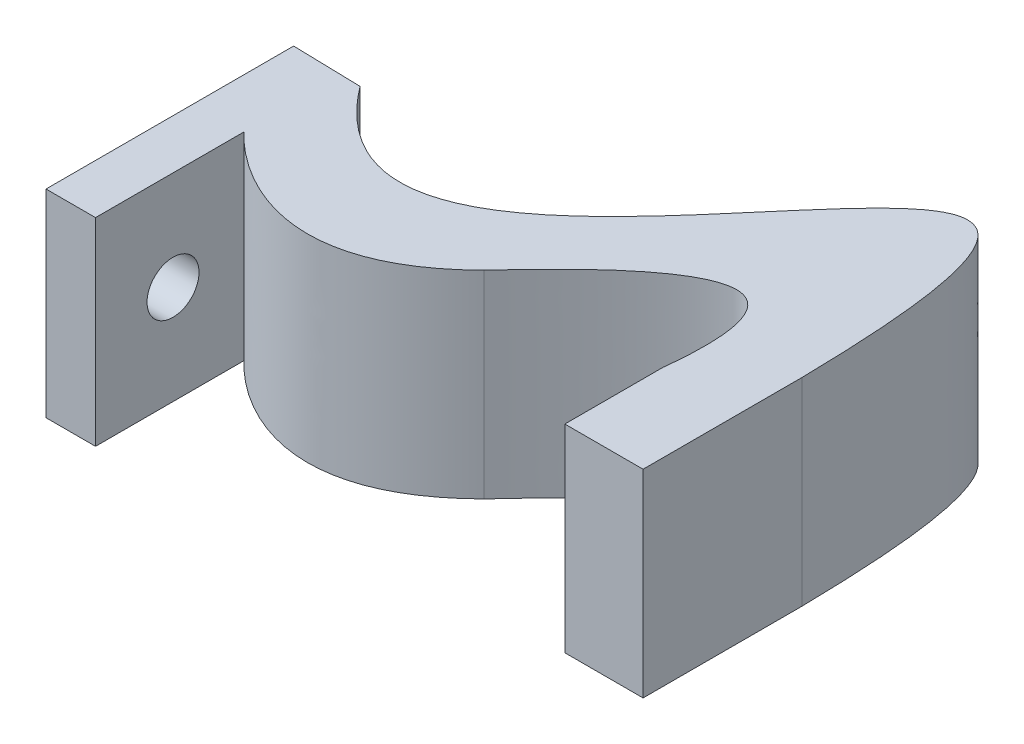
ISO-10303-21;
HEADER;
FILE_DESCRIPTION(('STEP AP214'),'2;1');
FILE_NAME('part.step','',(''),(''),'','','');
FILE_SCHEMA(('AUTOMOTIVE_DESIGN { 1 0 10303 214 1 1 1 1 }'));
ENDSEC;
DATA;
#1=APPLICATION_CONTEXT('core data for automotive mechanical design processes');
#2=APPLICATION_PROTOCOL_DEFINITION('international standard','automotive_design',2000,#1);
#3=PRODUCT_CONTEXT('',#1,'mechanical');
#4=PRODUCT('Part','Part','',(#3));
#5=PRODUCT_RELATED_PRODUCT_CATEGORY('part','',(#4));
#6=PRODUCT_DEFINITION_FORMATION('','',#4);
#7=PRODUCT_DEFINITION_CONTEXT('part definition',#1,'design');
#8=PRODUCT_DEFINITION('design','',#6,#7);
#9=PRODUCT_DEFINITION_SHAPE('','',#8);
#10=(LENGTH_UNIT() NAMED_UNIT(*) SI_UNIT(.MILLI.,.METRE.));
#11=(NAMED_UNIT(*) PLANE_ANGLE_UNIT() SI_UNIT($,.RADIAN.));
#12=(NAMED_UNIT(*) SI_UNIT($,.STERADIAN.) SOLID_ANGLE_UNIT());
#13=UNCERTAINTY_MEASURE_WITH_UNIT(LENGTH_MEASURE(1.E-05),#10,'distance_accuracy_value','');
#14=(GEOMETRIC_REPRESENTATION_CONTEXT(3) GLOBAL_UNCERTAINTY_ASSIGNED_CONTEXT((#13)) GLOBAL_UNIT_ASSIGNED_CONTEXT((#10,
#11,#12)) REPRESENTATION_CONTEXT('',''));
#15=CARTESIAN_POINT('',(0.,0.,0.));
#16=DIRECTION('',(0.,0.,1.));
#17=DIRECTION('',(1.,0.,0.));
#18=AXIS2_PLACEMENT_3D('',#15,#16,#17);
#19=CARTESIAN_POINT('',(-29.1994486491968,20.,4.82477370069274));
#20=DIRECTION('',(1.,0.,0.));
#21=DIRECTION('',(0.,0.,-1.));
#22=AXIS2_PLACEMENT_3D('',#19,#20,#21);
#23=PLANE('',#22);
#24=DIRECTION('',(0.,0.,1.));
#25=VECTOR('',#24,1.);
#26=CARTESIAN_POINT('',(-29.1994486491968,0.,4.82477370069274));
#27=LINE('',#26,#25);
#28=CARTESIAN_POINT('',(-29.1994486491968,0.,-9.99580208202526));
#29=VERTEX_POINT('',#28);
#30=CARTESIAN_POINT('',(-29.1994486491968,0.,15.0041979179747));
#31=VERTEX_POINT('',#30);
#32=EDGE_CURVE('E274',#29,#31,#27,.T.);
#33=ORIENTED_EDGE('',*,*,#32,.T.);
#34=DIRECTION('',(0.,-1.,0.));
#35=VECTOR('',#34,1.);
#36=CARTESIAN_POINT('',(-29.1994486491968,20.,15.0041979179747));
#37=LINE('',#36,#35);
#38=CARTESIAN_POINT('',(-29.1994486491968,20.,15.0041979179747));
#39=VERTEX_POINT('',#38);
#40=EDGE_CURVE('E295',#39,#31,#37,.T.);
#41=ORIENTED_EDGE('',*,*,#40,.F.);
#42=DIRECTION('',(0.,0.,1.));
#43=VECTOR('',#42,1.);
#44=CARTESIAN_POINT('',(-29.1994486491968,20.,4.82477370069274));
#45=LINE('',#44,#43);
#46=CARTESIAN_POINT('',(-29.1994486491968,20.,-9.99580208202526));
#47=VERTEX_POINT('',#46);
#48=EDGE_CURVE('E341',#47,#39,#45,.T.);
#49=ORIENTED_EDGE('',*,*,#48,.F.);
#50=DIRECTION('',(0.,-1.,0.));
#51=VECTOR('',#50,1.);
#52=CARTESIAN_POINT('',(-29.1994486491968,20.,-9.99580208202526));
#53=LINE('',#52,#51);
#54=EDGE_CURVE('E298',#47,#29,#53,.T.);
#55=ORIENTED_EDGE('',*,*,#54,.T.);
#56=EDGE_LOOP('',(#33,#41,#49,#55));
#57=FACE_BOUND('',#56,.T.);
#58=CARTESIAN_POINT('',(-29.1994486491968,10.,7.18193672926759));
#59=DIRECTION('',(1.,0.,0.));
#60=DIRECTION('',(0.,0.,-1.));
#61=AXIS2_PLACEMENT_3D('',#58,#59,#60);
#62=CIRCLE('',#61,2.625);
#63=CARTESIAN_POINT('',(-29.1994486491968,10.,4.55693672926759));
#64=VERTEX_POINT('',#63);
#65=EDGE_CURVE('E161',#64,#64,#62,.T.);
#66=ORIENTED_EDGE('',*,*,#65,.T.);
#67=EDGE_LOOP('',(#66));
#68=FACE_BOUND('',#67,.T.);
#69=DIRECTION('',(0.,1.,0.));
#70=VECTOR('',#69,1.);
#71=CARTESIAN_POINT('',(-29.1994486491968,12.5,2.32477370069274));
#72=LINE('',#71,#70);
#73=CARTESIAN_POINT('',(-29.1994486491968,7.5,2.32477370069274));
#74=VERTEX_POINT('',#73);
#75=CARTESIAN_POINT('',(-29.1994486491968,12.5,2.32477370069274));
#76=VERTEX_POINT('',#75);
#77=EDGE_CURVE('E157',#74,#76,#72,.T.);
#78=ORIENTED_EDGE('',*,*,#77,.F.);
#79=DIRECTION('',(0.,0.,1.));
#80=VECTOR('',#79,1.);
#81=CARTESIAN_POINT('',(-29.1994486491968,7.5,-6.49849086401856));
#82=LINE('',#81,#80);
#83=CARTESIAN_POINT('',(-29.1994486491968,7.5,-6.49849086401856));
#84=VERTEX_POINT('',#83);
#85=EDGE_CURVE('E154',#84,#74,#82,.T.);
#86=ORIENTED_EDGE('',*,*,#85,.F.);
#87=DIRECTION('',(0.,-1.,0.));
#88=VECTOR('',#87,1.);
#89=CARTESIAN_POINT('',(-29.1994486491968,12.5,-6.49849086401856));
#90=LINE('',#89,#88);
#91=CARTESIAN_POINT('',(-29.1994486491968,12.5,-6.49849086401856));
#92=VERTEX_POINT('',#91);
#93=EDGE_CURVE('E56',#92,#84,#90,.T.);
#94=ORIENTED_EDGE('',*,*,#93,.F.);
#95=DIRECTION('',(0.,0.,-1.));
#96=VECTOR('',#95,1.);
#97=CARTESIAN_POINT('',(-29.1994486491968,12.5,-6.49849086401856));
#98=LINE('',#97,#96);
#99=EDGE_CURVE('E51',#76,#92,#98,.T.);
#100=ORIENTED_EDGE('',*,*,#99,.F.);
#101=EDGE_LOOP('',(#78,#86,#94,#100));
#102=FACE_BOUND('',#101,.T.);
#103=ADVANCED_FACE('F35',(#57,#68,#102),#23,.F.);
#104=CARTESIAN_POINT('',(0.,20.,0.));
#105=CARTESIAN_POINT('',(19.8990084702364,20.,-21.8418661634811));
#106=CARTESIAN_POINT('',(17.536308623139,20.,-0.546329000484702));
#107=B_SPLINE_CURVE_WITH_KNOTS('',2,(#104,#105,#106),.UNSPECIFIED.,.F.,.F.,(3,3),(0.,1.),.UNSPECIFIED.);
#108=DIRECTION('',(0.,-1.,0.));
#109=VECTOR('',#108,1.);
#110=SURFACE_OF_LINEAR_EXTRUSION('',#107,#109);
#111=CARTESIAN_POINT('',(0.,0.,0.));
#112=CARTESIAN_POINT('',(19.8990084702364,0.,-21.8418661634811));
#113=CARTESIAN_POINT('',(17.536308623139,0.,-0.546329000484702));
#114=B_SPLINE_CURVE_WITH_KNOTS('',2,(#111,#112,#113),.UNSPECIFIED.,.F.,.F.,(3,3),(0.,1.),.UNSPECIFIED.);
#115=CARTESIAN_POINT('',(0.,0.,0.));
#116=VERTEX_POINT('',#115);
#117=CARTESIAN_POINT('',(17.536308623139,0.,-0.546329000484702));
#118=VERTEX_POINT('',#117);
#119=EDGE_CURVE('E168',#116,#118,#114,.T.);
#120=ORIENTED_EDGE('',*,*,#119,.T.);
#121=DIRECTION('',(0.,-1.,0.));
#122=VECTOR('',#121,1.);
#123=CARTESIAN_POINT('',(17.536308623139,20.,-0.546329000484702));
#124=LINE('',#123,#122);
#125=CARTESIAN_POINT('',(17.536308623139,20.,-0.546329000484702));
#126=VERTEX_POINT('',#125);
#127=EDGE_CURVE('E11',#126,#118,#124,.T.);
#128=ORIENTED_EDGE('',*,*,#127,.F.);
#129=CARTESIAN_POINT('',(0.,20.,0.));
#130=VERTEX_POINT('',#129);
#131=EDGE_CURVE('E169',#130,#126,#107,.T.);
#132=ORIENTED_EDGE('',*,*,#131,.F.);
#133=DIRECTION('',(0.,-1.,0.));
#134=VECTOR('',#133,1.);
#135=CARTESIAN_POINT('',(0.,20.,0.));
#136=LINE('',#135,#134);
#137=EDGE_CURVE('E245',#130,#116,#136,.T.);
#138=ORIENTED_EDGE('',*,*,#137,.T.);
#139=EDGE_LOOP('',(#120,#128,#132,#138));
#140=FACE_BOUND('',#139,.T.);
#141=ADVANCED_FACE('F37',(#140),#110,.F.);
#142=CARTESIAN_POINT('',(17.536308623139,20.,9.36262855660193));
#143=DIRECTION('',(1.,0.,0.));
#144=DIRECTION('',(0.,0.,-1.));
#145=AXIS2_PLACEMENT_3D('',#142,#143,#144);
#146=PLANE('',#145);
#147=DIRECTION('',(0.,0.,1.));
#148=VECTOR('',#147,1.);
#149=CARTESIAN_POINT('',(17.536308623139,0.,9.36262855660193));
#150=LINE('',#149,#148);
#151=CARTESIAN_POINT('',(17.536308623139,0.,9.36262855660193));
#152=VERTEX_POINT('',#151);
#153=EDGE_CURVE('E255',#118,#152,#150,.T.);
#154=ORIENTED_EDGE('',*,*,#153,.T.);
#155=DIRECTION('',(0.,-1.,0.));
#156=VECTOR('',#155,1.);
#157=CARTESIAN_POINT('',(17.536308623139,20.,9.36262855660193));
#158=LINE('',#157,#156);
#159=CARTESIAN_POINT('',(17.536308623139,20.,9.36262855660193));
#160=VERTEX_POINT('',#159);
#161=EDGE_CURVE('E44',#160,#152,#158,.T.);
#162=ORIENTED_EDGE('',*,*,#161,.F.);
#163=DIRECTION('',(0.,0.,1.));
#164=VECTOR('',#163,1.);
#165=CARTESIAN_POINT('',(17.536308623139,20.,9.36262855660193));
#166=LINE('',#165,#164);
#167=EDGE_CURVE('E175',#126,#160,#166,.T.);
#168=ORIENTED_EDGE('',*,*,#167,.F.);
#169=ORIENTED_EDGE('',*,*,#127,.T.);
#170=EDGE_LOOP('',(#154,#162,#168,#169));
#171=FACE_BOUND('',#170,.T.);
#172=ADVANCED_FACE('F209',(#171),#146,.F.);
#173=CARTESIAN_POINT('',(17.536308623139,20.,9.36262855660193));
#174=DIRECTION('',(0.,0.,-1.));
#175=DIRECTION('',(-1.,0.,0.));
#176=AXIS2_PLACEMENT_3D('',#173,#174,#175);
#177=PLANE('',#176);
#178=DIRECTION('',(1.,0.,0.));
#179=VECTOR('',#178,1.);
#180=CARTESIAN_POINT('',(17.536308623139,0.,9.36262855660193));
#181=LINE('',#180,#179);
#182=CARTESIAN_POINT('',(25.4362520448976,0.,9.36262855660193));
#183=VERTEX_POINT('',#182);
#184=EDGE_CURVE('E260',#152,#183,#181,.T.);
#185=ORIENTED_EDGE('',*,*,#184,.T.);
#186=DIRECTION('',(0.,-1.,0.));
#187=VECTOR('',#186,1.);
#188=CARTESIAN_POINT('',(25.4362520448976,20.,9.36262855660193));
#189=LINE('',#188,#187);
#190=CARTESIAN_POINT('',(25.4362520448976,20.,9.36262855660193));
#191=VERTEX_POINT('',#190);
#192=EDGE_CURVE('E307',#191,#183,#189,.T.);
#193=ORIENTED_EDGE('',*,*,#192,.F.);
#194=DIRECTION('',(1.,0.,0.));
#195=VECTOR('',#194,1.);
#196=CARTESIAN_POINT('',(17.536308623139,20.,9.36262855660193));
#197=LINE('',#196,#195);
#198=EDGE_CURVE('E181',#160,#191,#197,.T.);
#199=ORIENTED_EDGE('',*,*,#198,.F.);
#200=ORIENTED_EDGE('',*,*,#161,.T.);
#201=EDGE_LOOP('',(#185,#193,#199,#200));
#202=FACE_BOUND('',#201,.T.);
#203=ADVANCED_FACE('F206',(#202),#177,.F.);
#204=CARTESIAN_POINT('',(25.4362520448976,20.,-6.65949360147754));
#205=DIRECTION('',(-1.,0.,0.));
#206=DIRECTION('',(0.,0.,1.));
#207=AXIS2_PLACEMENT_3D('',#204,#205,#206);
#208=PLANE('',#207);
#209=DIRECTION('',(0.,0.,-1.));
#210=VECTOR('',#209,1.);
#211=CARTESIAN_POINT('',(25.4362520448976,0.,-6.65949360147754));
#212=LINE('',#211,#210);
#213=CARTESIAN_POINT('',(25.4362520448976,0.,-6.65949360147754));
#214=VERTEX_POINT('',#213);
#215=EDGE_CURVE('E262',#183,#214,#212,.T.);
#216=ORIENTED_EDGE('',*,*,#215,.T.);
#217=DIRECTION('',(0.,-1.,0.));
#218=VECTOR('',#217,1.);
#219=CARTESIAN_POINT('',(25.4362520448976,20.,-6.65949360147754));
#220=LINE('',#219,#218);
#221=CARTESIAN_POINT('',(25.4362520448976,20.,-6.65949360147754));
#222=VERTEX_POINT('',#221);
#223=EDGE_CURVE('E304',#222,#214,#220,.T.);
#224=ORIENTED_EDGE('',*,*,#223,.F.);
#225=DIRECTION('',(0.,0.,-1.));
#226=VECTOR('',#225,1.);
#227=CARTESIAN_POINT('',(25.4362520448976,20.,-6.65949360147754));
#228=LINE('',#227,#226);
#229=EDGE_CURVE('E183',#191,#222,#228,.T.);
#230=ORIENTED_EDGE('',*,*,#229,.F.);
#231=ORIENTED_EDGE('',*,*,#192,.T.);
#232=EDGE_LOOP('',(#216,#224,#230,#231));
#233=FACE_BOUND('',#232,.T.);
#234=ADVANCED_FACE('F201',(#233),#208,.F.);
#235=CARTESIAN_POINT('',(25.4362520448976,20.,-6.65949360147754));
#236=CARTESIAN_POINT('',(24.4675679168571,20.,-67.6815702831061));
#237=CARTESIAN_POINT('',(0.232629533672082,20.,19.940907612402));
#238=CARTESIAN_POINT('',(-22.3223794125158,20.,-9.82225081540406));
#239=B_SPLINE_CURVE_WITH_KNOTS('',3,(#235,#236,#237,#238),.UNSPECIFIED.,.F.,.F.,(4,4),(0.,1.),.UNSPECIFIED.);
#240=DIRECTION('',(0.,-1.,0.));
#241=VECTOR('',#240,1.);
#242=SURFACE_OF_LINEAR_EXTRUSION('',#239,#241);
#243=CARTESIAN_POINT('',(25.4362520448976,0.,-6.65949360147754));
#244=CARTESIAN_POINT('',(24.4675679168571,0.,-67.6815702831061));
#245=CARTESIAN_POINT('',(0.232629533672082,0.,19.940907612402));
#246=CARTESIAN_POINT('',(-22.3223794125158,0.,-9.82225081540406));
#247=B_SPLINE_CURVE_WITH_KNOTS('',3,(#243,#244,#245,#246),.UNSPECIFIED.,.F.,.F.,(4,4),(0.,1.),.UNSPECIFIED.);
#248=CARTESIAN_POINT('',(-22.3223794125158,0.,-9.82225081540406));
#249=VERTEX_POINT('',#248);
#250=EDGE_CURVE('E264',#214,#249,#247,.T.);
#251=ORIENTED_EDGE('',*,*,#250,.T.);
#252=DIRECTION('',(0.,-1.,0.));
#253=VECTOR('',#252,1.);
#254=CARTESIAN_POINT('',(-22.3223794125158,20.,-9.82225081540406));
#255=LINE('',#254,#253);
#256=CARTESIAN_POINT('',(-22.3223794125158,20.,-9.82225081540406));
#257=VERTEX_POINT('',#256);
#258=EDGE_CURVE('E301',#257,#249,#255,.T.);
#259=ORIENTED_EDGE('',*,*,#258,.F.);
#260=EDGE_CURVE('E185',#222,#257,#239,.T.);
#261=ORIENTED_EDGE('',*,*,#260,.F.);
#262=ORIENTED_EDGE('',*,*,#223,.T.);
#263=EDGE_LOOP('',(#251,#259,#261,#262));
#264=FACE_BOUND('',#263,.T.);
#265=ADVANCED_FACE('F196',(#264),#242,.F.);
#266=CARTESIAN_POINT('',(-29.1994486491968,20.,-9.99580208202526));
#267=DIRECTION('',(-0.0252281927797256,0.,0.999681718492976));
#268=DIRECTION('',(0.999681718492976,0.,0.0252281927797256));
#269=AXIS2_PLACEMENT_3D('',#266,#267,#268);
#270=PLANE('',#269);
#271=DIRECTION('',(-0.999681718492976,0.,-0.0252281927797255));
#272=VECTOR('',#271,1.);
#273=CARTESIAN_POINT('',(-29.1994486491968,0.,-9.99580208202526));
#274=LINE('',#273,#272);
#275=EDGE_CURVE('E268',#249,#29,#274,.T.);
#276=ORIENTED_EDGE('',*,*,#275,.T.);
#277=ORIENTED_EDGE('',*,*,#54,.F.);
#278=DIRECTION('',(-0.999681718492976,0.,-0.0252281927797255));
#279=VECTOR('',#278,1.);
#280=CARTESIAN_POINT('',(-29.1994486491968,20.,-9.99580208202526));
#281=LINE('',#280,#279);
#282=EDGE_CURVE('E190',#257,#47,#281,.T.);
#283=ORIENTED_EDGE('',*,*,#282,.F.);
#284=ORIENTED_EDGE('',*,*,#258,.T.);
#285=EDGE_LOOP('',(#276,#277,#283,#284));
#286=FACE_BOUND('',#285,.T.);
#287=ADVANCED_FACE('F200',(#286),#270,.F.);
#288=CARTESIAN_POINT('',(-29.1994486491968,20.,15.0041979179747));
#289=DIRECTION('',(0.,0.,-1.));
#290=DIRECTION('',(-1.,0.,0.));
#291=AXIS2_PLACEMENT_3D('',#288,#289,#290);
#292=PLANE('',#291);
#293=DIRECTION('',(1.,0.,0.));
#294=VECTOR('',#293,1.);
#295=CARTESIAN_POINT('',(-29.1994486491968,0.,15.0041979179747));
#296=LINE('',#295,#294);
#297=CARTESIAN_POINT('',(-24.1994486491968,0.,15.0041979179747));
#298=VERTEX_POINT('',#297);
#299=EDGE_CURVE('E276',#31,#298,#296,.T.);
#300=ORIENTED_EDGE('',*,*,#299,.T.);
#301=DIRECTION('',(0.,-1.,0.));
#302=VECTOR('',#301,1.);
#303=CARTESIAN_POINT('',(-24.1994486491968,20.,15.0041979179747));
#304=LINE('',#303,#302);
#305=CARTESIAN_POINT('',(-24.1994486491968,20.,15.0041979179747));
#306=VERTEX_POINT('',#305);
#307=EDGE_CURVE('E292',#306,#298,#304,.T.);
#308=ORIENTED_EDGE('',*,*,#307,.F.);
#309=DIRECTION('',(1.,0.,0.));
#310=VECTOR('',#309,1.);
#311=CARTESIAN_POINT('',(-29.1994486491968,20.,15.0041979179747));
#312=LINE('',#311,#310);
#313=EDGE_CURVE('E337',#39,#306,#312,.T.);
#314=ORIENTED_EDGE('',*,*,#313,.F.);
#315=ORIENTED_EDGE('',*,*,#40,.T.);
#316=EDGE_LOOP('',(#300,#308,#314,#315));
#317=FACE_BOUND('',#316,.T.);
#318=ADVANCED_FACE('F223',(#317),#292,.F.);
#319=CARTESIAN_POINT('',(-24.1994486491968,20.,0.));
#320=DIRECTION('',(-1.,0.,0.));
#321=DIRECTION('',(0.,0.,1.));
#322=AXIS2_PLACEMENT_3D('',#319,#320,#321);
#323=PLANE('',#322);
#324=CARTESIAN_POINT('',(-24.1994486491968,10.,7.18193672926759));
#325=DIRECTION('',(1.,0.,0.));
#326=DIRECTION('',(0.,0.,-1.));
#327=AXIS2_PLACEMENT_3D('',#324,#325,#326);
#328=CIRCLE('',#327,2.625);
#329=CARTESIAN_POINT('',(-24.1994486491968,10.,4.55693672926759));
#330=VERTEX_POINT('',#329);
#331=EDGE_CURVE('E158',#330,#330,#328,.T.);
#332=ORIENTED_EDGE('',*,*,#331,.F.);
#333=EDGE_LOOP('',(#332));
#334=FACE_BOUND('',#333,.T.);
#335=DIRECTION('',(0.,0.,-1.));
#336=VECTOR('',#335,1.);
#337=CARTESIAN_POINT('',(-24.1994486491968,0.,0.));
#338=LINE('',#337,#336);
#339=CARTESIAN_POINT('',(-24.1994486491968,0.,0.));
#340=VERTEX_POINT('',#339);
#341=EDGE_CURVE('E279',#298,#340,#338,.T.);
#342=ORIENTED_EDGE('',*,*,#341,.T.);
#343=DIRECTION('',(0.,-1.,0.));
#344=VECTOR('',#343,1.);
#345=CARTESIAN_POINT('',(-24.1994486491968,20.,0.));
#346=LINE('',#345,#344);
#347=CARTESIAN_POINT('',(-24.1994486491968,20.,0.));
#348=VERTEX_POINT('',#347);
#349=EDGE_CURVE('E289',#348,#340,#346,.T.);
#350=ORIENTED_EDGE('',*,*,#349,.F.);
#351=DIRECTION('',(0.,0.,-1.));
#352=VECTOR('',#351,1.);
#353=CARTESIAN_POINT('',(-24.1994486491968,20.,15.0041979179747));
#354=LINE('',#353,#352);
#355=EDGE_CURVE('E246',#306,#348,#354,.T.);
#356=ORIENTED_EDGE('',*,*,#355,.F.);
#357=ORIENTED_EDGE('',*,*,#307,.T.);
#358=EDGE_LOOP('',(#342,#350,#356,#357));
#359=FACE_BOUND('',#358,.T.);
#360=ADVANCED_FACE('F226',(#334,#359),#323,.F.);
#361=CARTESIAN_POINT('',(-24.1994486491968,20.,0.));
#362=CARTESIAN_POINT('',(-24.1977984812668,20.,0.00193179393291763));
#363=CARTESIAN_POINT('',(-13.0339990207192,20.,12.8900586652268));
#364=CARTESIAN_POINT('',(0.,20.,0.));
#365=B_SPLINE_CURVE_WITH_KNOTS('',3,(#361,#362,#363,#364),.UNSPECIFIED.,.F.,.F.,(4,4),(0.,1.),.UNSPECIFIED.);
#366=DIRECTION('',(0.,-1.,0.));
#367=VECTOR('',#366,1.);
#368=SURFACE_OF_LINEAR_EXTRUSION('',#365,#367);
#369=CARTESIAN_POINT('',(-24.1994486491968,0.,0.));
#370=CARTESIAN_POINT('',(-24.1977984812668,0.,0.00193179393291763));
#371=CARTESIAN_POINT('',(-13.0339990207192,0.,12.8900586652268));
#372=CARTESIAN_POINT('',(0.,0.,0.));
#373=B_SPLINE_CURVE_WITH_KNOTS('',3,(#369,#370,#371,#372),.UNSPECIFIED.,.F.,.F.,(4,4),(0.,1.),.UNSPECIFIED.);
#374=EDGE_CURVE('E176',#340,#116,#373,.T.);
#375=ORIENTED_EDGE('',*,*,#374,.T.);
#376=ORIENTED_EDGE('',*,*,#137,.F.);
#377=EDGE_CURVE('E239',#348,#130,#365,.T.);
#378=ORIENTED_EDGE('',*,*,#377,.F.);
#379=ORIENTED_EDGE('',*,*,#349,.T.);
#380=EDGE_LOOP('',(#375,#376,#378,#379));
#381=FACE_BOUND('',#380,.T.);
#382=ADVANCED_FACE('F230',(#381),#368,.F.);
#383=CARTESIAN_POINT('',(14.333581390903,20.,-11.0575153318617));
#384=DIRECTION('',(0.,1.,0.));
#385=DIRECTION('',(0.,0.,1.));
#386=AXIS2_PLACEMENT_3D('',#383,#384,#385);
#387=PLANE('',#386);
#388=ORIENTED_EDGE('',*,*,#131,.T.);
#389=ORIENTED_EDGE('',*,*,#167,.T.);
#390=ORIENTED_EDGE('',*,*,#198,.T.);
#391=ORIENTED_EDGE('',*,*,#229,.T.);
#392=ORIENTED_EDGE('',*,*,#260,.T.);
#393=ORIENTED_EDGE('',*,*,#282,.T.);
#394=ORIENTED_EDGE('',*,*,#48,.T.);
#395=ORIENTED_EDGE('',*,*,#313,.T.);
#396=ORIENTED_EDGE('',*,*,#355,.T.);
#397=ORIENTED_EDGE('',*,*,#377,.T.);
#398=EDGE_LOOP('',(#388,#389,#390,#391,#392,#393,#394,#395,#396,#397));
#399=FACE_BOUND('',#398,.T.);
#400=ADVANCED_FACE('F235',(#399),#387,.T.);
#401=CARTESIAN_POINT('',(14.333581390903,0.,-11.0575153318617));
#402=DIRECTION('',(0.,1.,0.));
#403=DIRECTION('',(0.,0.,1.));
#404=AXIS2_PLACEMENT_3D('',#401,#402,#403);
#405=PLANE('',#404);
#406=ORIENTED_EDGE('',*,*,#119,.F.);
#407=ORIENTED_EDGE('',*,*,#374,.F.);
#408=ORIENTED_EDGE('',*,*,#341,.F.);
#409=ORIENTED_EDGE('',*,*,#299,.F.);
#410=ORIENTED_EDGE('',*,*,#32,.F.);
#411=ORIENTED_EDGE('',*,*,#275,.F.);
#412=ORIENTED_EDGE('',*,*,#250,.F.);
#413=ORIENTED_EDGE('',*,*,#215,.F.);
#414=ORIENTED_EDGE('',*,*,#184,.F.);
#415=ORIENTED_EDGE('',*,*,#153,.F.);
#416=EDGE_LOOP('',(#406,#407,#408,#409,#410,#411,#412,#413,#414,#415));
#417=FACE_BOUND('',#416,.T.);
#418=ADVANCED_FACE('F237',(#417),#405,.F.);
#419=CARTESIAN_POINT('',(-29.1994486491968,10.,7.18193672926759));
#420=DIRECTION('',(1.,0.,0.));
#421=DIRECTION('',(0.,0.,-1.));
#422=AXIS2_PLACEMENT_3D('',#419,#420,#421);
#423=CYLINDRICAL_SURFACE('',#422,2.625);
#424=ORIENTED_EDGE('',*,*,#65,.F.);
#425=EDGE_LOOP('',(#424));
#426=FACE_BOUND('',#425,.T.);
#427=ORIENTED_EDGE('',*,*,#331,.T.);
#428=EDGE_LOOP('',(#427));
#429=FACE_BOUND('',#428,.T.);
#430=ADVANCED_FACE('F371',(#426,#429),#423,.F.);
#431=CARTESIAN_POINT('',(-29.6994486491968,12.5,2.32477370069274));
#432=DIRECTION('',(0.,0.,-1.));
#433=DIRECTION('',(0.,1.,0.));
#434=AXIS2_PLACEMENT_3D('',#431,#432,#433);
#435=PLANE('',#434);
#436=ORIENTED_EDGE('',*,*,#77,.T.);
#437=DIRECTION('',(1.,0.,0.));
#438=VECTOR('',#437,1.);
#439=CARTESIAN_POINT('',(-29.6994486491968,12.5,2.32477370069274));
#440=LINE('',#439,#438);
#441=CARTESIAN_POINT('',(-29.6994486491968,12.5,2.32477370069274));
#442=VERTEX_POINT('',#441);
#443=EDGE_CURVE('E138',#442,#76,#440,.T.);
#444=ORIENTED_EDGE('',*,*,#443,.F.);
#445=DIRECTION('',(0.,1.,0.));
#446=VECTOR('',#445,1.);
#447=CARTESIAN_POINT('',(-29.6994486491968,12.5,2.32477370069274));
#448=LINE('',#447,#446);
#449=CARTESIAN_POINT('',(-29.6994486491968,7.5,2.32477370069274));
#450=VERTEX_POINT('',#449);
#451=EDGE_CURVE('E145',#450,#442,#448,.T.);
#452=ORIENTED_EDGE('',*,*,#451,.F.);
#453=DIRECTION('',(1.,0.,0.));
#454=VECTOR('',#453,1.);
#455=CARTESIAN_POINT('',(-29.6994486491968,7.5,2.32477370069274));
#456=LINE('',#455,#454);
#457=EDGE_CURVE('E475',#450,#74,#456,.T.);
#458=ORIENTED_EDGE('',*,*,#457,.T.);
#459=EDGE_LOOP('',(#436,#444,#452,#458));
#460=FACE_BOUND('',#459,.T.);
#461=ADVANCED_FACE('F156',(#460),#435,.F.);
#462=CARTESIAN_POINT('',(-29.6994486491968,12.5,-6.49849086401856));
#463=DIRECTION('',(0.,-1.,0.));
#464=DIRECTION('',(0.,0.,-1.));
#465=AXIS2_PLACEMENT_3D('',#462,#463,#464);
#466=PLANE('',#465);
#467=ORIENTED_EDGE('',*,*,#99,.T.);
#468=DIRECTION('',(1.,0.,0.));
#469=VECTOR('',#468,1.);
#470=CARTESIAN_POINT('',(-29.6994486491968,12.5,-6.49849086401856));
#471=LINE('',#470,#469);
#472=CARTESIAN_POINT('',(-29.6994486491968,12.5,-6.49849086401856));
#473=VERTEX_POINT('',#472);
#474=EDGE_CURVE('E141',#473,#92,#471,.T.);
#475=ORIENTED_EDGE('',*,*,#474,.F.);
#476=DIRECTION('',(0.,0.,-1.));
#477=VECTOR('',#476,1.);
#478=CARTESIAN_POINT('',(-29.6994486491968,12.5,-6.49849086401856));
#479=LINE('',#478,#477);
#480=EDGE_CURVE('E134',#442,#473,#479,.T.);
#481=ORIENTED_EDGE('',*,*,#480,.F.);
#482=ORIENTED_EDGE('',*,*,#443,.T.);
#483=EDGE_LOOP('',(#467,#475,#481,#482));
#484=FACE_BOUND('',#483,.T.);
#485=ADVANCED_FACE('F136',(#484),#466,.F.);
#486=CARTESIAN_POINT('',(-29.6994486491968,12.5,-6.49849086401856));
#487=DIRECTION('',(0.,0.,1.));
#488=DIRECTION('',(0.,-1.,0.));
#489=AXIS2_PLACEMENT_3D('',#486,#487,#488);
#490=PLANE('',#489);
#491=ORIENTED_EDGE('',*,*,#93,.T.);
#492=DIRECTION('',(1.,0.,0.));
#493=VECTOR('',#492,1.);
#494=CARTESIAN_POINT('',(-29.6994486491968,7.5,-6.49849086401856));
#495=LINE('',#494,#493);
#496=CARTESIAN_POINT('',(-29.6994486491968,7.5,-6.49849086401856));
#497=VERTEX_POINT('',#496);
#498=EDGE_CURVE('E163',#497,#84,#495,.T.);
#499=ORIENTED_EDGE('',*,*,#498,.F.);
#500=DIRECTION('',(0.,-1.,0.));
#501=VECTOR('',#500,1.);
#502=CARTESIAN_POINT('',(-29.6994486491968,12.5,-6.49849086401856));
#503=LINE('',#502,#501);
#504=EDGE_CURVE('E144',#473,#497,#503,.T.);
#505=ORIENTED_EDGE('',*,*,#504,.F.);
#506=ORIENTED_EDGE('',*,*,#474,.T.);
#507=EDGE_LOOP('',(#491,#499,#505,#506));
#508=FACE_BOUND('',#507,.T.);
#509=ADVANCED_FACE('F389',(#508),#490,.F.);
#510=CARTESIAN_POINT('',(-29.6994486491968,7.5,-6.49849086401856));
#511=DIRECTION('',(0.,1.,0.));
#512=DIRECTION('',(0.,0.,1.));
#513=AXIS2_PLACEMENT_3D('',#510,#511,#512);
#514=PLANE('',#513);
#515=ORIENTED_EDGE('',*,*,#85,.T.);
#516=ORIENTED_EDGE('',*,*,#457,.F.);
#517=DIRECTION('',(0.,0.,1.));
#518=VECTOR('',#517,1.);
#519=CARTESIAN_POINT('',(-29.6994486491968,7.5,-6.49849086401856));
#520=LINE('',#519,#518);
#521=EDGE_CURVE('E150',#497,#450,#520,.T.);
#522=ORIENTED_EDGE('',*,*,#521,.F.);
#523=ORIENTED_EDGE('',*,*,#498,.T.);
#524=EDGE_LOOP('',(#515,#516,#522,#523));
#525=FACE_BOUND('',#524,.T.);
#526=ADVANCED_FACE('F396',(#525),#514,.F.);
#527=CARTESIAN_POINT('',(-29.6994486491968,0.,0.));
#528=DIRECTION('',(-1.,0.,0.));
#529=DIRECTION('',(0.,0.,1.));
#530=AXIS2_PLACEMENT_3D('',#527,#528,#529);
#531=PLANE('',#530);
#532=ORIENTED_EDGE('',*,*,#451,.T.);
#533=ORIENTED_EDGE('',*,*,#480,.T.);
#534=ORIENTED_EDGE('',*,*,#504,.T.);
#535=ORIENTED_EDGE('',*,*,#521,.T.);
#536=EDGE_LOOP('',(#532,#533,#534,#535));
#537=FACE_BOUND('',#536,.T.);
#538=ADVANCED_FACE('F148',(#537),#531,.T.);
#539=CLOSED_SHELL('',(#103,#141,#172,#203,#234,#265,#287,#318,#360,#382,#400,#418,#430,#461,
#485,#509,#526,#538));
#540=MANIFOLD_SOLID_BREP('B2',#539);
#541=ADVANCED_BREP_SHAPE_REPRESENTATION('',(#18,#540),#14);
#542=SHAPE_DEFINITION_REPRESENTATION(#9,#541);
ENDSEC;
END-ISO-10303-21;
